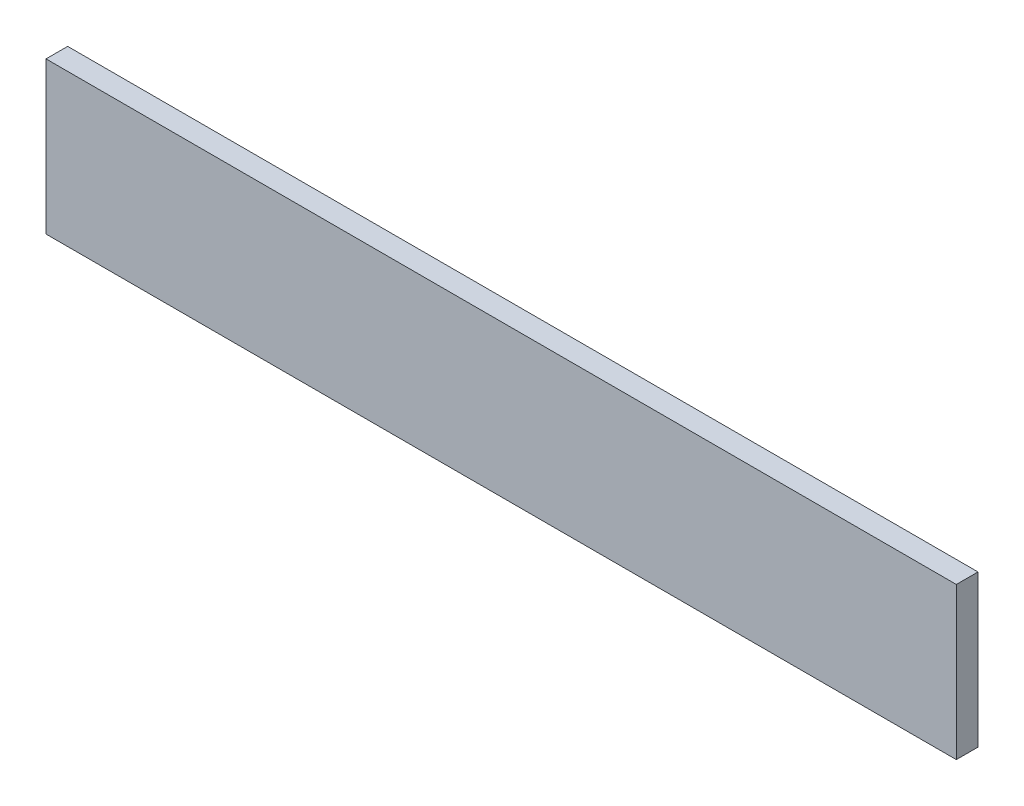
ISO-10303-21;
HEADER;
FILE_DESCRIPTION(('STEP AP214'),'2;1');
FILE_NAME('part.step','',(''),(''),'','','');
FILE_SCHEMA(('AUTOMOTIVE_DESIGN { 1 0 10303 214 1 1 1 1 }'));
ENDSEC;
DATA;
#1=APPLICATION_CONTEXT('core data for automotive mechanical design processes');
#2=APPLICATION_PROTOCOL_DEFINITION('international standard','automotive_design',2000,#1);
#3=PRODUCT_CONTEXT('',#1,'mechanical');
#4=PRODUCT('Part','Part','',(#3));
#5=PRODUCT_RELATED_PRODUCT_CATEGORY('part','',(#4));
#6=PRODUCT_DEFINITION_FORMATION('','',#4);
#7=PRODUCT_DEFINITION_CONTEXT('part definition',#1,'design');
#8=PRODUCT_DEFINITION('design','',#6,#7);
#9=PRODUCT_DEFINITION_SHAPE('','',#8);
#10=(LENGTH_UNIT() NAMED_UNIT(*) SI_UNIT(.MILLI.,.METRE.));
#11=(NAMED_UNIT(*) PLANE_ANGLE_UNIT() SI_UNIT($,.RADIAN.));
#12=(NAMED_UNIT(*) SI_UNIT($,.STERADIAN.) SOLID_ANGLE_UNIT());
#13=UNCERTAINTY_MEASURE_WITH_UNIT(LENGTH_MEASURE(1.E-05),#10,'distance_accuracy_value','');
#14=(GEOMETRIC_REPRESENTATION_CONTEXT(3) GLOBAL_UNCERTAINTY_ASSIGNED_CONTEXT((#13)) GLOBAL_UNIT_ASSIGNED_CONTEXT((#10,
#11,#12)) REPRESENTATION_CONTEXT('',''));
#15=CARTESIAN_POINT('',(0.,0.,0.));
#16=DIRECTION('',(0.,0.,1.));
#17=DIRECTION('',(1.,0.,0.));
#18=AXIS2_PLACEMENT_3D('',#15,#16,#17);
#19=CARTESIAN_POINT('',(-191.870503597122,43.6185611510791,12.7));
#20=DIRECTION('',(1.,0.,0.));
#21=DIRECTION('',(0.,0.,-1.));
#22=AXIS2_PLACEMENT_3D('',#19,#20,#21);
#23=PLANE('',#22);
#24=DIRECTION('',(0.,-1.,0.));
#25=VECTOR('',#24,1.);
#26=CARTESIAN_POINT('',(-191.870503597122,43.6185611510791,0.));
#27=LINE('',#26,#25);
#28=CARTESIAN_POINT('',(-191.870503597122,43.6185611510791,0.));
#29=VERTEX_POINT('',#28);
#30=CARTESIAN_POINT('',(-191.870503597122,-45.2814388489209,0.));
#31=VERTEX_POINT('',#30);
#32=EDGE_CURVE('E107',#29,#31,#27,.T.);
#33=ORIENTED_EDGE('',*,*,#32,.T.);
#34=DIRECTION('',(0.,0.,-1.));
#35=VECTOR('',#34,1.);
#36=CARTESIAN_POINT('',(-191.870503597122,-45.2814388489209,12.7));
#37=LINE('',#36,#35);
#38=CARTESIAN_POINT('',(-191.870503597122,-45.2814388489209,12.7));
#39=VERTEX_POINT('',#38);
#40=EDGE_CURVE('E11',#39,#31,#37,.T.);
#41=ORIENTED_EDGE('',*,*,#40,.F.);
#42=DIRECTION('',(0.,-1.,0.));
#43=VECTOR('',#42,1.);
#44=CARTESIAN_POINT('',(-191.870503597122,43.6185611510791,12.7));
#45=LINE('',#44,#43);
#46=CARTESIAN_POINT('',(-191.870503597122,43.6185611510791,12.7));
#47=VERTEX_POINT('',#46);
#48=EDGE_CURVE('E91',#47,#39,#45,.T.);
#49=ORIENTED_EDGE('',*,*,#48,.F.);
#50=DIRECTION('',(0.,0.,-1.));
#51=VECTOR('',#50,1.);
#52=CARTESIAN_POINT('',(-191.870503597122,43.6185611510791,12.7));
#53=LINE('',#52,#51);
#54=EDGE_CURVE('E103',#47,#29,#53,.T.);
#55=ORIENTED_EDGE('',*,*,#54,.T.);
#56=EDGE_LOOP('',(#33,#41,#49,#55));
#57=FACE_BOUND('',#56,.T.);
#58=ADVANCED_FACE('F39',(#57),#23,.F.);
#59=CARTESIAN_POINT('',(-191.870503597122,-45.2814388489209,12.7));
#60=DIRECTION('',(0.,1.,0.));
#61=DIRECTION('',(0.,0.,1.));
#62=AXIS2_PLACEMENT_3D('',#59,#60,#61);
#63=PLANE('',#62);
#64=DIRECTION('',(1.,0.,0.));
#65=VECTOR('',#64,1.);
#66=CARTESIAN_POINT('',(-191.870503597122,-45.2814388489209,0.));
#67=LINE('',#66,#65);
#68=CARTESIAN_POINT('',(341.529496402878,-45.2814388489209,0.));
#69=VERTEX_POINT('',#68);
#70=EDGE_CURVE('E96',#31,#69,#67,.T.);
#71=ORIENTED_EDGE('',*,*,#70,.T.);
#72=DIRECTION('',(0.,0.,-1.));
#73=VECTOR('',#72,1.);
#74=CARTESIAN_POINT('',(341.529496402878,-45.2814388489209,12.7));
#75=LINE('',#74,#73);
#76=CARTESIAN_POINT('',(341.529496402878,-45.2814388489209,12.7));
#77=VERTEX_POINT('',#76);
#78=EDGE_CURVE('E48',#77,#69,#75,.T.);
#79=ORIENTED_EDGE('',*,*,#78,.F.);
#80=DIRECTION('',(1.,0.,0.));
#81=VECTOR('',#80,1.);
#82=CARTESIAN_POINT('',(-191.870503597122,-45.2814388489209,12.7));
#83=LINE('',#82,#81);
#84=EDGE_CURVE('E86',#39,#77,#83,.T.);
#85=ORIENTED_EDGE('',*,*,#84,.F.);
#86=ORIENTED_EDGE('',*,*,#40,.T.);
#87=EDGE_LOOP('',(#71,#79,#85,#86));
#88=FACE_BOUND('',#87,.T.);
#89=ADVANCED_FACE('F95',(#88),#63,.F.);
#90=CARTESIAN_POINT('',(341.529496402878,43.6185611510791,12.7));
#91=DIRECTION('',(-1.,0.,0.));
#92=DIRECTION('',(0.,0.,1.));
#93=AXIS2_PLACEMENT_3D('',#90,#91,#92);
#94=PLANE('',#93);
#95=DIRECTION('',(0.,1.,0.));
#96=VECTOR('',#95,1.);
#97=CARTESIAN_POINT('',(341.529496402878,43.6185611510791,0.));
#98=LINE('',#97,#96);
#99=CARTESIAN_POINT('',(341.529496402878,43.6185611510791,0.));
#100=VERTEX_POINT('',#99);
#101=EDGE_CURVE('E73',#69,#100,#98,.T.);
#102=ORIENTED_EDGE('',*,*,#101,.T.);
#103=DIRECTION('',(0.,0.,-1.));
#104=VECTOR('',#103,1.);
#105=CARTESIAN_POINT('',(341.529496402878,43.6185611510791,12.7));
#106=LINE('',#105,#104);
#107=CARTESIAN_POINT('',(341.529496402878,43.6185611510791,12.7));
#108=VERTEX_POINT('',#107);
#109=EDGE_CURVE('E98',#108,#100,#106,.T.);
#110=ORIENTED_EDGE('',*,*,#109,.F.);
#111=DIRECTION('',(0.,1.,0.));
#112=VECTOR('',#111,1.);
#113=CARTESIAN_POINT('',(341.529496402878,43.6185611510791,12.7));
#114=LINE('',#113,#112);
#115=EDGE_CURVE('E89',#77,#108,#114,.T.);
#116=ORIENTED_EDGE('',*,*,#115,.F.);
#117=ORIENTED_EDGE('',*,*,#78,.T.);
#118=EDGE_LOOP('',(#102,#110,#116,#117));
#119=FACE_BOUND('',#118,.T.);
#120=ADVANCED_FACE('F99',(#119),#94,.F.);
#121=CARTESIAN_POINT('',(-191.870503597122,43.6185611510791,12.7));
#122=DIRECTION('',(0.,-1.,0.));
#123=DIRECTION('',(0.,0.,-1.));
#124=AXIS2_PLACEMENT_3D('',#121,#122,#123);
#125=PLANE('',#124);
#126=DIRECTION('',(-1.,0.,0.));
#127=VECTOR('',#126,1.);
#128=CARTESIAN_POINT('',(-191.870503597122,43.6185611510791,0.));
#129=LINE('',#128,#127);
#130=EDGE_CURVE('E79',#100,#29,#129,.T.);
#131=ORIENTED_EDGE('',*,*,#130,.T.);
#132=ORIENTED_EDGE('',*,*,#54,.F.);
#133=DIRECTION('',(-1.,0.,0.));
#134=VECTOR('',#133,1.);
#135=CARTESIAN_POINT('',(-191.870503597122,43.6185611510791,12.7));
#136=LINE('',#135,#134);
#137=EDGE_CURVE('E56',#108,#47,#136,.T.);
#138=ORIENTED_EDGE('',*,*,#137,.F.);
#139=ORIENTED_EDGE('',*,*,#109,.T.);
#140=EDGE_LOOP('',(#131,#132,#138,#139));
#141=FACE_BOUND('',#140,.T.);
#142=ADVANCED_FACE('F120',(#141),#125,.F.);
#143=CARTESIAN_POINT('',(0.,0.,12.7));
#144=DIRECTION('',(0.,0.,1.));
#145=DIRECTION('',(1.,0.,0.));
#146=AXIS2_PLACEMENT_3D('',#143,#144,#145);
#147=PLANE('',#146);
#148=ORIENTED_EDGE('',*,*,#48,.T.);
#149=ORIENTED_EDGE('',*,*,#84,.T.);
#150=ORIENTED_EDGE('',*,*,#115,.T.);
#151=ORIENTED_EDGE('',*,*,#137,.T.);
#152=EDGE_LOOP('',(#148,#149,#150,#151));
#153=FACE_BOUND('',#152,.T.);
#154=ADVANCED_FACE('F87',(#153),#147,.T.);
#155=CARTESIAN_POINT('',(0.,0.,0.));
#156=DIRECTION('',(0.,0.,1.));
#157=DIRECTION('',(1.,0.,0.));
#158=AXIS2_PLACEMENT_3D('',#155,#156,#157);
#159=PLANE('',#158);
#160=ORIENTED_EDGE('',*,*,#32,.F.);
#161=ORIENTED_EDGE('',*,*,#130,.F.);
#162=ORIENTED_EDGE('',*,*,#101,.F.);
#163=ORIENTED_EDGE('',*,*,#70,.F.);
#164=EDGE_LOOP('',(#160,#161,#162,#163));
#165=FACE_BOUND('',#164,.T.);
#166=ADVANCED_FACE('F123',(#165),#159,.F.);
#167=CLOSED_SHELL('',(#58,#89,#120,#142,#154,#166));
#168=MANIFOLD_SOLID_BREP('B2',#167);
#169=ADVANCED_BREP_SHAPE_REPRESENTATION('',(#18,#168),#14);
#170=SHAPE_DEFINITION_REPRESENTATION(#9,#169);
ENDSEC;
END-ISO-10303-21;
